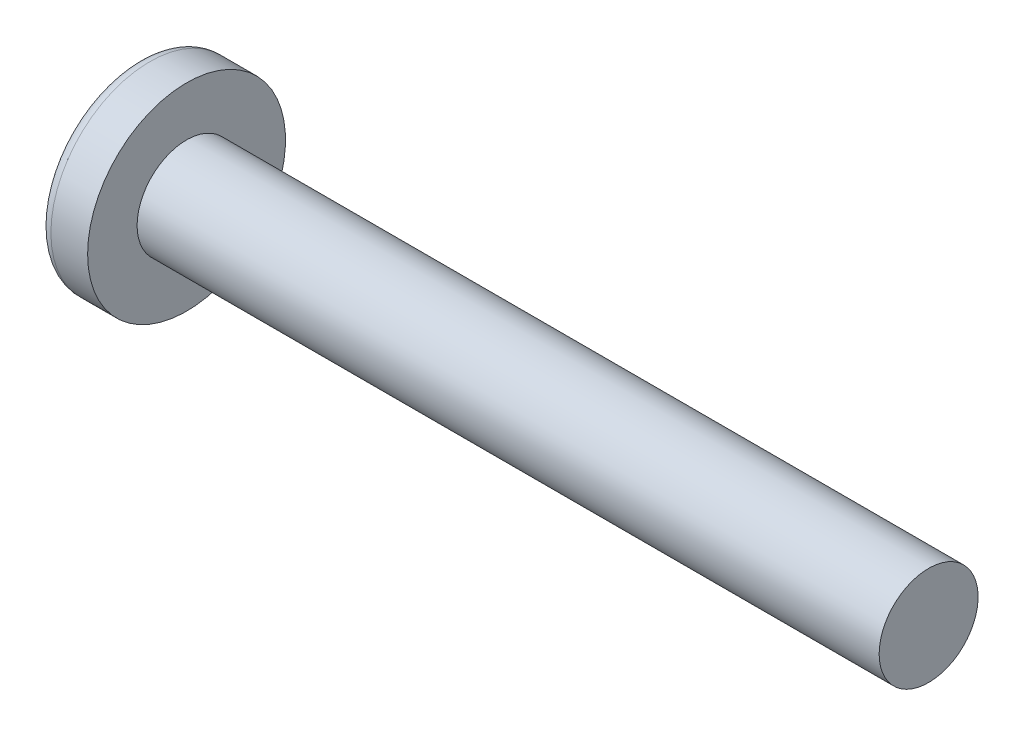
ISO-10303-21;
HEADER;
FILE_DESCRIPTION(('STEP AP214'),'2;1');
FILE_NAME('part.step','',(''),(''),'','','');
FILE_SCHEMA(('AUTOMOTIVE_DESIGN { 1 0 10303 214 1 1 1 1 }'));
ENDSEC;
DATA;
#1=APPLICATION_CONTEXT('core data for automotive mechanical design processes');
#2=APPLICATION_PROTOCOL_DEFINITION('international standard','automotive_design',2000,#1);
#3=PRODUCT_CONTEXT('',#1,'mechanical');
#4=PRODUCT('Part','Part','',(#3));
#5=PRODUCT_RELATED_PRODUCT_CATEGORY('part','',(#4));
#6=PRODUCT_DEFINITION_FORMATION('','',#4);
#7=PRODUCT_DEFINITION_CONTEXT('part definition',#1,'design');
#8=PRODUCT_DEFINITION('design','',#6,#7);
#9=PRODUCT_DEFINITION_SHAPE('','',#8);
#10=(LENGTH_UNIT() NAMED_UNIT(*) SI_UNIT(.MILLI.,.METRE.));
#11=(NAMED_UNIT(*) PLANE_ANGLE_UNIT() SI_UNIT($,.RADIAN.));
#12=(NAMED_UNIT(*) SI_UNIT($,.STERADIAN.) SOLID_ANGLE_UNIT());
#13=UNCERTAINTY_MEASURE_WITH_UNIT(LENGTH_MEASURE(1.E-05),#10,'distance_accuracy_value','');
#14=(GEOMETRIC_REPRESENTATION_CONTEXT(3) GLOBAL_UNCERTAINTY_ASSIGNED_CONTEXT((#13)) GLOBAL_UNIT_ASSIGNED_CONTEXT((#10,
#11,#12)) REPRESENTATION_CONTEXT('',''));
#15=CARTESIAN_POINT('',(0.,0.,0.));
#16=DIRECTION('',(0.,0.,1.));
#17=DIRECTION('',(1.,0.,0.));
#18=AXIS2_PLACEMENT_3D('',#15,#16,#17);
#19=CARTESIAN_POINT('',(6.5,0.,0.));
#20=DIRECTION('',(-1.,0.,0.));
#21=DIRECTION('',(0.,1.,0.));
#22=AXIS2_PLACEMENT_3D('',#19,#20,#21);
#23=SPHERICAL_SURFACE('',#22,6.5);
#24=CARTESIAN_POINT('',(1.22696010591455,0.,0.));
#25=DIRECTION('',(-1.,0.,0.));
#26=DIRECTION('',(0.,0.,1.));
#27=AXIS2_PLACEMENT_3D('',#24,#25,#26);
#28=CIRCLE('',#27,3.80066445182724);
#29=CARTESIAN_POINT('',(1.22696010591455,0.,3.80066445182724));
#30=VERTEX_POINT('',#29);
#31=EDGE_CURVE('E154',#30,#30,#28,.T.);
#32=ORIENTED_EDGE('',*,*,#31,.T.);
#33=EDGE_LOOP('',(#32));
#34=FACE_BOUND('',#33,.T.);
#35=CARTESIAN_POINT('',(6.48571960757402,-0.15048155459631,0.));
#36=DIRECTION('',(-0.0944735162161081,-0.995527375180494,0.));
#37=DIRECTION('',(0.995527375180495,-0.0944735162161082,0.));
#38=AXIS2_PLACEMENT_3D('',#35,#36,#37);
#39=CIRCLE('',#38,6.49824217555167);
#40=CARTESIAN_POINT('',(0.314004666074214,0.435201598015399,1.94783502836694));
#41=VERTEX_POINT('',#40);
#42=CARTESIAN_POINT('',(0.0329034112486444,0.461877533422321,0.461877533422322));
#43=VERTEX_POINT('',#42);
#44=EDGE_CURVE('E185',#41,#43,#39,.T.);
#45=ORIENTED_EDGE('',*,*,#44,.F.);
#46=CARTESIAN_POINT('',(5.02565375064329,0.,-1.83590765485334));
#47=DIRECTION('',(0.626149356629992,0.,0.779703137861998));
#48=DIRECTION('',(0.779703137861998,0.,-0.626149356629992));
#49=AXIS2_PLACEMENT_3D('',#46,#47,#48);
#50=CIRCLE('',#49,6.05852673674539);
#51=CARTESIAN_POINT('',(0.314004666074214,-0.435201598015413,1.94783502836693));
#52=VERTEX_POINT('',#51);
#53=EDGE_CURVE('E150',#41,#52,#50,.T.);
#54=ORIENTED_EDGE('',*,*,#53,.T.);
#55=CARTESIAN_POINT('',(6.48571960757402,0.15048155459631,0.));
#56=DIRECTION('',(-0.094473516216108,0.995527375180494,0.));
#57=DIRECTION('',(-0.995527375180495,-0.094473516216108,0.));
#58=AXIS2_PLACEMENT_3D('',#55,#56,#57);
#59=CIRCLE('',#58,6.49824217555167);
#60=CARTESIAN_POINT('',(0.0329034112486444,-0.461877533422324,0.461877533422322));
#61=VERTEX_POINT('',#60);
#62=EDGE_CURVE('E106',#61,#52,#59,.T.);
#63=ORIENTED_EDGE('',*,*,#62,.F.);
#64=CARTESIAN_POINT('',(6.48571960757402,0.,-0.15048155459631));
#65=DIRECTION('',(-0.094473516216108,0.,-0.995527375180494));
#66=DIRECTION('',(-0.995527375180495,0.,0.094473516216108));
#67=AXIS2_PLACEMENT_3D('',#64,#65,#66);
#68=CIRCLE('',#67,6.49824217555167);
#69=CARTESIAN_POINT('',(0.314004666074212,-1.94783502836693,0.435201598015406));
#70=VERTEX_POINT('',#69);
#71=EDGE_CURVE('E131',#70,#61,#68,.T.);
#72=ORIENTED_EDGE('',*,*,#71,.F.);
#73=CARTESIAN_POINT('',(5.02565375064329,1.83590765485334,0.));
#74=DIRECTION('',(0.626149356629992,-0.779703137861998,0.));
#75=DIRECTION('',(0.779703137861998,0.626149356629992,0.));
#76=AXIS2_PLACEMENT_3D('',#73,#74,#75);
#77=CIRCLE('',#76,6.05852673674539);
#78=CARTESIAN_POINT('',(0.314004666074212,-1.94783502836693,-0.435201598015406));
#79=VERTEX_POINT('',#78);
#80=EDGE_CURVE('E139',#70,#79,#77,.T.);
#81=ORIENTED_EDGE('',*,*,#80,.T.);
#82=CARTESIAN_POINT('',(6.48571960757402,0.,0.15048155459631));
#83=DIRECTION('',(-0.0944735162161081,0.,0.995527375180494));
#84=DIRECTION('',(0.995527375180495,0.,0.0944735162161082));
#85=AXIS2_PLACEMENT_3D('',#82,#83,#84);
#86=CIRCLE('',#85,6.49824217555167);
#87=CARTESIAN_POINT('',(0.0329034112486444,-0.461877533422321,-0.461877533422323));
#88=VERTEX_POINT('',#87);
#89=EDGE_CURVE('E49',#88,#79,#86,.T.);
#90=ORIENTED_EDGE('',*,*,#89,.F.);
#91=CARTESIAN_POINT('',(0.314004666074212,-0.435201598015399,-1.94783502836693));
#92=VERTEX_POINT('',#91);
#93=EDGE_CURVE('E192',#92,#88,#59,.T.);
#94=ORIENTED_EDGE('',*,*,#93,.F.);
#95=CARTESIAN_POINT('',(5.02565375064329,0.,1.83590765485334));
#96=DIRECTION('',(0.626149356629992,0.,-0.779703137861998));
#97=DIRECTION('',(-0.779703137861998,0.,-0.626149356629992));
#98=AXIS2_PLACEMENT_3D('',#95,#96,#97);
#99=CIRCLE('',#98,6.05852673674539);
#100=CARTESIAN_POINT('',(0.314004666074212,0.435201598015413,-1.94783502836693));
#101=VERTEX_POINT('',#100);
#102=EDGE_CURVE('E132',#92,#101,#99,.T.);
#103=ORIENTED_EDGE('',*,*,#102,.T.);
#104=CARTESIAN_POINT('',(0.0329034112486444,0.461877533422324,-0.461877533422323));
#105=VERTEX_POINT('',#104);
#106=EDGE_CURVE('E180',#105,#101,#39,.T.);
#107=ORIENTED_EDGE('',*,*,#106,.F.);
#108=CARTESIAN_POINT('',(0.314004666074214,1.94783502836693,-0.435201598015406));
#109=VERTEX_POINT('',#108);
#110=EDGE_CURVE('E42',#109,#105,#86,.T.);
#111=ORIENTED_EDGE('',*,*,#110,.F.);
#112=CARTESIAN_POINT('',(5.02565375064329,-1.83590765485334,0.));
#113=DIRECTION('',(0.626149356629992,0.779703137861998,0.));
#114=DIRECTION('',(-0.779703137861998,0.626149356629992,0.));
#115=AXIS2_PLACEMENT_3D('',#112,#113,#114);
#116=CIRCLE('',#115,6.05852673674539);
#117=CARTESIAN_POINT('',(0.314004666074213,1.94783502836693,0.435201598015406));
#118=VERTEX_POINT('',#117);
#119=EDGE_CURVE('E11',#109,#118,#116,.T.);
#120=ORIENTED_EDGE('',*,*,#119,.T.);
#121=EDGE_CURVE('E168',#43,#118,#68,.T.);
#122=ORIENTED_EDGE('',*,*,#121,.F.);
#123=EDGE_LOOP('',(#45,#54,#63,#72,#81,#90,#94,#103,#107,#111,#120,#122));
#124=FACE_BOUND('',#123,.T.);
#125=ADVANCED_FACE('F34',(#34,#124),#23,.T.);
#126=CARTESIAN_POINT('',(2.73951715374841,0.,-0.20502541296061));
#127=DIRECTION('',(-0.0944735162161081,0.,0.995527375180494));
#128=DIRECTION('',(0.995527375180495,0.,0.0944735162161082));
#129=AXIS2_PLACEMENT_3D('',#126,#127,#128);
#130=PLANE('',#129);
#131=ORIENTED_EDGE('',*,*,#110,.T.);
#132=DIRECTION('',(0.991114231601325,-0.0940547178968607,0.0940547178968604));
#133=VECTOR('',#132,1.);
#134=CARTESIAN_POINT('',(2.75862941145706,0.203211698708667,-0.203211698708667));
#135=LINE('',#134,#133);
#136=CARTESIAN_POINT('',(2.45,0.232500000000001,-0.232499999999999));
#137=VERTEX_POINT('',#136);
#138=EDGE_CURVE('E174',#105,#137,#135,.T.);
#139=ORIENTED_EDGE('',*,*,#138,.T.);
#140=DIRECTION('',(0.777577482844895,-0.624442325509114,0.0737905162291584));
#141=VECTOR('',#140,1.);
#142=CARTESIAN_POINT('',(0.,2.2,-0.465));
#143=LINE('',#142,#141);
#144=EDGE_CURVE('E155',#109,#137,#143,.T.);
#145=ORIENTED_EDGE('',*,*,#144,.F.);
#146=EDGE_LOOP('',(#131,#139,#145));
#147=FACE_BOUND('',#146,.T.);
#148=ADVANCED_FACE('F173',(#147),#130,.T.);
#149=DIRECTION('',(0.777577482844895,0.624442325509115,0.0737905162291584));
#150=VECTOR('',#149,1.);
#151=CARTESIAN_POINT('',(0.,-2.2,-0.465));
#152=LINE('',#151,#150);
#153=CARTESIAN_POINT('',(2.45,-0.2325,-0.2325));
#154=VERTEX_POINT('',#153);
#155=EDGE_CURVE('E140',#79,#154,#152,.T.);
#156=ORIENTED_EDGE('',*,*,#155,.T.);
#157=DIRECTION('',(-0.991114231601325,-0.0940547178968599,-0.0940547178968604));
#158=VECTOR('',#157,1.);
#159=CARTESIAN_POINT('',(2.75862941145706,-0.203211698708666,-0.203211698708667));
#160=LINE('',#159,#158);
#161=EDGE_CURVE('E195',#154,#88,#160,.T.);
#162=ORIENTED_EDGE('',*,*,#161,.T.);
#163=ORIENTED_EDGE('',*,*,#89,.T.);
#164=EDGE_LOOP('',(#156,#162,#163));
#165=FACE_BOUND('',#164,.T.);
#166=ADVANCED_FACE('F210',(#165),#130,.T.);
#167=CARTESIAN_POINT('',(2.73951715374841,0.,0.20502541296061));
#168=DIRECTION('',(-0.094473516216108,0.,-0.995527375180494));
#169=DIRECTION('',(-0.995527375180495,0.,0.094473516216108));
#170=AXIS2_PLACEMENT_3D('',#167,#168,#169);
#171=PLANE('',#170);
#172=DIRECTION('',(0.777577482844895,-0.624442325509115,-0.0737905162291584));
#173=VECTOR('',#172,1.);
#174=CARTESIAN_POINT('',(0.,2.2,0.465));
#175=LINE('',#174,#173);
#176=CARTESIAN_POINT('',(2.45,0.2325,0.2325));
#177=VERTEX_POINT('',#176);
#178=EDGE_CURVE('E211',#118,#177,#175,.T.);
#179=ORIENTED_EDGE('',*,*,#178,.T.);
#180=DIRECTION('',(-0.991114231601325,0.0940547178968601,0.0940547178968603));
#181=VECTOR('',#180,1.);
#182=CARTESIAN_POINT('',(2.75862941145706,0.203211698708666,0.203211698708667));
#183=LINE('',#182,#181);
#184=EDGE_CURVE('E189',#177,#43,#183,.T.);
#185=ORIENTED_EDGE('',*,*,#184,.T.);
#186=ORIENTED_EDGE('',*,*,#121,.T.);
#187=EDGE_LOOP('',(#179,#185,#186));
#188=FACE_BOUND('',#187,.T.);
#189=ADVANCED_FACE('F215',(#188),#171,.T.);
#190=ORIENTED_EDGE('',*,*,#71,.T.);
#191=DIRECTION('',(0.991114231601325,0.0940547178968606,-0.0940547178968603));
#192=VECTOR('',#191,1.);
#193=CARTESIAN_POINT('',(2.75862941145706,-0.203211698708668,0.203211698708667));
#194=LINE('',#193,#192);
#195=CARTESIAN_POINT('',(2.45,-0.232500000000001,0.232499999999999));
#196=VERTEX_POINT('',#195);
#197=EDGE_CURVE('E104',#61,#196,#194,.T.);
#198=ORIENTED_EDGE('',*,*,#197,.T.);
#199=DIRECTION('',(0.777577482844895,0.624442325509114,-0.0737905162291582));
#200=VECTOR('',#199,1.);
#201=CARTESIAN_POINT('',(0.,-2.2,0.464999999999999));
#202=LINE('',#201,#200);
#203=EDGE_CURVE('E129',#70,#196,#202,.T.);
#204=ORIENTED_EDGE('',*,*,#203,.F.);
#205=EDGE_LOOP('',(#190,#198,#204));
#206=FACE_BOUND('',#205,.T.);
#207=ADVANCED_FACE('F128',(#206),#171,.T.);
#208=CARTESIAN_POINT('',(-25.4,0.,0.));
#209=DIRECTION('',(-1.,0.,0.));
#210=DIRECTION('',(0.,0.,1.));
#211=AXIS2_PLACEMENT_3D('',#208,#209,#210);
#212=CYLINDRICAL_SURFACE('',#211,2.);
#213=CARTESIAN_POINT('',(33.1,0.,0.));
#214=DIRECTION('',(-1.,0.,0.));
#215=DIRECTION('',(0.,0.,1.));
#216=AXIS2_PLACEMENT_3D('',#213,#214,#215);
#217=CIRCLE('',#216,2.);
#218=CARTESIAN_POINT('',(33.1,0.,2.));
#219=VERTEX_POINT('',#218);
#220=EDGE_CURVE('E151',#219,#219,#217,.T.);
#221=ORIENTED_EDGE('',*,*,#220,.T.);
#222=EDGE_LOOP('',(#221));
#223=FACE_BOUND('',#222,.T.);
#224=CARTESIAN_POINT('',(3.1,0.,0.));
#225=DIRECTION('',(-1.,0.,0.));
#226=DIRECTION('',(0.,0.,1.));
#227=AXIS2_PLACEMENT_3D('',#224,#225,#226);
#228=CIRCLE('',#227,2.);
#229=CARTESIAN_POINT('',(3.1,0.,2.));
#230=VERTEX_POINT('',#229);
#231=EDGE_CURVE('E164',#230,#230,#228,.T.);
#232=ORIENTED_EDGE('',*,*,#231,.F.);
#233=EDGE_LOOP('',(#232));
#234=FACE_BOUND('',#233,.T.);
#235=ADVANCED_FACE('F36',(#223,#234),#212,.T.);
#236=CARTESIAN_POINT('',(3.1,2.,0.));
#237=DIRECTION('',(-1.,0.,0.));
#238=DIRECTION('',(0.,0.,1.));
#239=AXIS2_PLACEMENT_3D('',#236,#237,#238);
#240=PLANE('',#239);
#241=CARTESIAN_POINT('',(3.1,0.,0.));
#242=DIRECTION('',(-1.,0.,0.));
#243=DIRECTION('',(0.,0.,1.));
#244=AXIS2_PLACEMENT_3D('',#241,#242,#243);
#245=CIRCLE('',#244,4.);
#246=CARTESIAN_POINT('',(3.1,0.,4.));
#247=VERTEX_POINT('',#246);
#248=EDGE_CURVE('E161',#247,#247,#245,.T.);
#249=ORIENTED_EDGE('',*,*,#248,.F.);
#250=EDGE_LOOP('',(#249));
#251=FACE_BOUND('',#250,.T.);
#252=ORIENTED_EDGE('',*,*,#231,.T.);
#253=EDGE_LOOP('',(#252));
#254=FACE_BOUND('',#253,.T.);
#255=ADVANCED_FACE('F243',(#251,#254),#240,.F.);
#256=CARTESIAN_POINT('',(-25.4,0.,0.));
#257=DIRECTION('',(-1.,0.,0.));
#258=DIRECTION('',(0.,0.,1.));
#259=AXIS2_PLACEMENT_3D('',#256,#257,#258);
#260=CYLINDRICAL_SURFACE('',#259,4.);
#261=ORIENTED_EDGE('',*,*,#248,.T.);
#262=EDGE_LOOP('',(#261));
#263=FACE_BOUND('',#262,.T.);
#264=CARTESIAN_POINT('',(1.61635382117009,0.,0.));
#265=DIRECTION('',(-1.,0.,0.));
#266=DIRECTION('',(0.,0.,1.));
#267=AXIS2_PLACEMENT_3D('',#264,#265,#266);
#268=CIRCLE('',#267,4.);
#269=CARTESIAN_POINT('',(1.61635382117009,0.,4.));
#270=VERTEX_POINT('',#269);
#271=EDGE_CURVE('E158',#270,#270,#268,.T.);
#272=ORIENTED_EDGE('',*,*,#271,.F.);
#273=EDGE_LOOP('',(#272));
#274=FACE_BOUND('',#273,.T.);
#275=ADVANCED_FACE('F240',(#263,#274),#260,.T.);
#276=CARTESIAN_POINT('',(1.61635382117009,0.,0.));
#277=DIRECTION('',(-1.,0.,0.));
#278=DIRECTION('',(0.,0.,1.));
#279=AXIS2_PLACEMENT_3D('',#276,#277,#278);
#280=TOROIDAL_SURFACE('',#279,3.52,0.480000000000001);
#281=ORIENTED_EDGE('',*,*,#271,.T.);
#282=EDGE_LOOP('',(#281));
#283=FACE_BOUND('',#282,.T.);
#284=ORIENTED_EDGE('',*,*,#31,.F.);
#285=EDGE_LOOP('',(#284));
#286=FACE_BOUND('',#285,.T.);
#287=ADVANCED_FACE('F237',(#283,#286),#280,.T.);
#288=CARTESIAN_POINT('',(33.1,2.,0.));
#289=DIRECTION('',(1.,0.,0.));
#290=DIRECTION('',(0.,0.,-1.));
#291=AXIS2_PLACEMENT_3D('',#288,#289,#290);
#292=PLANE('',#291);
#293=ORIENTED_EDGE('',*,*,#220,.F.);
#294=EDGE_LOOP('',(#293));
#295=FACE_BOUND('',#294,.T.);
#296=ADVANCED_FACE('F235',(#295),#292,.T.);
#297=CARTESIAN_POINT('',(2.45,0.2325,0.2325));
#298=DIRECTION('',(0.626149356629992,0.779703137861998,0.));
#299=DIRECTION('',(-0.779703137861998,0.626149356629992,0.));
#300=AXIS2_PLACEMENT_3D('',#297,#298,#299);
#301=PLANE('',#300);
#302=ORIENTED_EDGE('',*,*,#144,.T.);
#303=DIRECTION('',(0.,0.,-1.));
#304=VECTOR('',#303,1.);
#305=CARTESIAN_POINT('',(2.45,0.2325,0.2325));
#306=LINE('',#305,#304);
#307=EDGE_CURVE('E122',#177,#137,#306,.T.);
#308=ORIENTED_EDGE('',*,*,#307,.F.);
#309=ORIENTED_EDGE('',*,*,#178,.F.);
#310=ORIENTED_EDGE('',*,*,#119,.F.);
#311=EDGE_LOOP('',(#302,#308,#309,#310));
#312=FACE_BOUND('',#311,.T.);
#313=ADVANCED_FACE('F214',(#312),#301,.F.);
#314=CARTESIAN_POINT('',(2.45,-0.2325,-0.2325));
#315=DIRECTION('',(0.626149356629992,-0.779703137861998,0.));
#316=DIRECTION('',(0.779703137861998,0.626149356629992,0.));
#317=AXIS2_PLACEMENT_3D('',#314,#315,#316);
#318=PLANE('',#317);
#319=ORIENTED_EDGE('',*,*,#203,.T.);
#320=DIRECTION('',(0.,0.,1.));
#321=VECTOR('',#320,1.);
#322=CARTESIAN_POINT('',(2.45,-0.2325,-0.2325));
#323=LINE('',#322,#321);
#324=EDGE_CURVE('E121',#154,#196,#323,.T.);
#325=ORIENTED_EDGE('',*,*,#324,.F.);
#326=ORIENTED_EDGE('',*,*,#155,.F.);
#327=ORIENTED_EDGE('',*,*,#80,.F.);
#328=EDGE_LOOP('',(#319,#325,#326,#327));
#329=FACE_BOUND('',#328,.T.);
#330=ADVANCED_FACE('F136',(#329),#318,.F.);
#331=CARTESIAN_POINT('',(2.45,0.2325,-0.2325));
#332=DIRECTION('',(-1.,0.,0.));
#333=DIRECTION('',(0.,0.,1.));
#334=AXIS2_PLACEMENT_3D('',#331,#332,#333);
#335=PLANE('',#334);
#336=DIRECTION('',(0.,1.,0.));
#337=VECTOR('',#336,1.);
#338=CARTESIAN_POINT('',(2.45,-0.2325,-0.2325));
#339=LINE('',#338,#337);
#340=EDGE_CURVE('E144',#154,#137,#339,.T.);
#341=ORIENTED_EDGE('',*,*,#340,.F.);
#342=ORIENTED_EDGE('',*,*,#324,.T.);
#343=DIRECTION('',(0.,-1.,0.));
#344=VECTOR('',#343,1.);
#345=CARTESIAN_POINT('',(2.45,0.2325,0.2325));
#346=LINE('',#345,#344);
#347=EDGE_CURVE('E113',#177,#196,#346,.T.);
#348=ORIENTED_EDGE('',*,*,#347,.F.);
#349=ORIENTED_EDGE('',*,*,#307,.T.);
#350=EDGE_LOOP('',(#341,#342,#348,#349));
#351=FACE_BOUND('',#350,.T.);
#352=ADVANCED_FACE('F142',(#351),#335,.T.);
#353=CARTESIAN_POINT('',(2.45,0.232500000000001,-0.232499999999999));
#354=DIRECTION('',(0.626149356629992,0.,-0.779703137861998));
#355=DIRECTION('',(0.779703137861998,0.,0.626149356629992));
#356=AXIS2_PLACEMENT_3D('',#353,#354,#355);
#357=PLANE('',#356);
#358=DIRECTION('',(0.777577482844895,0.0737905162291561,0.624442325509115));
#359=VECTOR('',#358,1.);
#360=CARTESIAN_POINT('',(0.,-0.464999999999992,-2.2));
#361=LINE('',#360,#359);
#362=EDGE_CURVE('E200',#92,#154,#361,.T.);
#363=ORIENTED_EDGE('',*,*,#362,.T.);
#364=ORIENTED_EDGE('',*,*,#340,.T.);
#365=DIRECTION('',(0.777577482844895,-0.0737905162291606,0.624442325509114));
#366=VECTOR('',#365,1.);
#367=CARTESIAN_POINT('',(0.,0.465000000000008,-2.2));
#368=LINE('',#367,#366);
#369=EDGE_CURVE('E110',#101,#137,#368,.T.);
#370=ORIENTED_EDGE('',*,*,#369,.F.);
#371=ORIENTED_EDGE('',*,*,#102,.F.);
#372=EDGE_LOOP('',(#363,#364,#370,#371));
#373=FACE_BOUND('',#372,.T.);
#374=ADVANCED_FACE('F205',(#373),#357,.F.);
#375=CARTESIAN_POINT('',(2.73951715374841,-0.20502541296061,0.));
#376=DIRECTION('',(-0.094473516216108,0.995527375180494,0.));
#377=DIRECTION('',(-0.995527375180495,-0.094473516216108,0.));
#378=AXIS2_PLACEMENT_3D('',#375,#376,#377);
#379=PLANE('',#378);
#380=ORIENTED_EDGE('',*,*,#93,.T.);
#381=ORIENTED_EDGE('',*,*,#161,.F.);
#382=ORIENTED_EDGE('',*,*,#362,.F.);
#383=EDGE_LOOP('',(#380,#381,#382));
#384=FACE_BOUND('',#383,.T.);
#385=ADVANCED_FACE('F209',(#384),#379,.T.);
#386=CARTESIAN_POINT('',(2.73951715374841,0.20502541296061,0.));
#387=DIRECTION('',(-0.0944735162161081,-0.995527375180494,0.));
#388=DIRECTION('',(0.995527375180495,-0.0944735162161082,0.));
#389=AXIS2_PLACEMENT_3D('',#386,#387,#388);
#390=PLANE('',#389);
#391=ORIENTED_EDGE('',*,*,#106,.T.);
#392=ORIENTED_EDGE('',*,*,#369,.T.);
#393=ORIENTED_EDGE('',*,*,#138,.F.);
#394=EDGE_LOOP('',(#391,#392,#393));
#395=FACE_BOUND('',#394,.T.);
#396=ADVANCED_FACE('F203',(#395),#390,.T.);
#397=CARTESIAN_POINT('',(2.45,-0.232500000000001,0.232499999999999));
#398=DIRECTION('',(0.626149356629992,0.,0.779703137861998));
#399=DIRECTION('',(-0.779703137861998,0.,0.626149356629992));
#400=AXIS2_PLACEMENT_3D('',#397,#398,#399);
#401=PLANE('',#400);
#402=DIRECTION('',(0.777577482844895,-0.0737905162291562,-0.624442325509115));
#403=VECTOR('',#402,1.);
#404=CARTESIAN_POINT('',(0.,0.464999999999992,2.2));
#405=LINE('',#404,#403);
#406=EDGE_CURVE('E109',#41,#177,#405,.T.);
#407=ORIENTED_EDGE('',*,*,#406,.T.);
#408=ORIENTED_EDGE('',*,*,#347,.T.);
#409=DIRECTION('',(0.777577482844895,0.0737905162291606,-0.624442325509114));
#410=VECTOR('',#409,1.);
#411=CARTESIAN_POINT('',(0.,-0.465000000000008,2.2));
#412=LINE('',#411,#410);
#413=EDGE_CURVE('E100',#52,#196,#412,.T.);
#414=ORIENTED_EDGE('',*,*,#413,.F.);
#415=ORIENTED_EDGE('',*,*,#53,.F.);
#416=EDGE_LOOP('',(#407,#408,#414,#415));
#417=FACE_BOUND('',#416,.T.);
#418=ADVANCED_FACE('F114',(#417),#401,.F.);
#419=ORIENTED_EDGE('',*,*,#44,.T.);
#420=ORIENTED_EDGE('',*,*,#184,.F.);
#421=ORIENTED_EDGE('',*,*,#406,.F.);
#422=EDGE_LOOP('',(#419,#420,#421));
#423=FACE_BOUND('',#422,.T.);
#424=ADVANCED_FACE('F216',(#423),#390,.T.);
#425=ORIENTED_EDGE('',*,*,#62,.T.);
#426=ORIENTED_EDGE('',*,*,#413,.T.);
#427=ORIENTED_EDGE('',*,*,#197,.F.);
#428=EDGE_LOOP('',(#425,#426,#427));
#429=FACE_BOUND('',#428,.T.);
#430=ADVANCED_FACE('F102',(#429),#379,.T.);
#431=CLOSED_SHELL('',(#125,#148,#166,#189,#207,#235,#255,#275,#287,#296,#313,#330,#352,#374,
#385,#396,#418,#424,#430));
#432=MANIFOLD_SOLID_BREP('B2',#431);
#433=ADVANCED_BREP_SHAPE_REPRESENTATION('',(#18,#432),#14);
#434=SHAPE_DEFINITION_REPRESENTATION(#9,#433);
ENDSEC;
END-ISO-10303-21;
